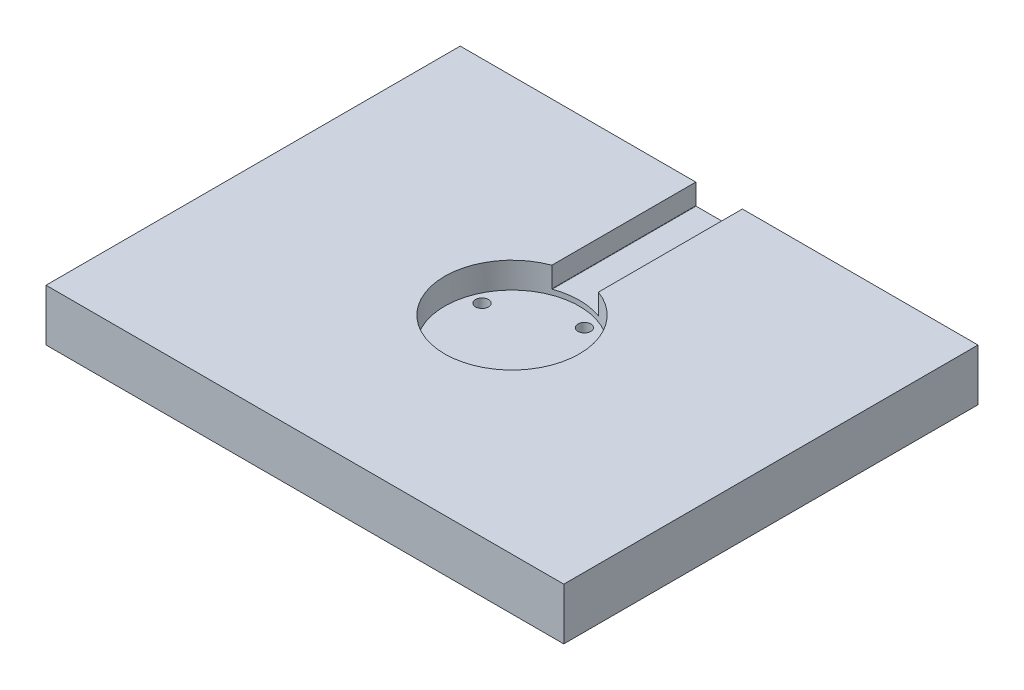
ISO-10303-21;
HEADER;
FILE_DESCRIPTION(('STEP AP214'),'2;1');
FILE_NAME('part.step','',(''),(''),'','','');
FILE_SCHEMA(('AUTOMOTIVE_DESIGN { 1 0 10303 214 1 1 1 1 }'));
ENDSEC;
DATA;
#1=APPLICATION_CONTEXT('core data for automotive mechanical design processes');
#2=APPLICATION_PROTOCOL_DEFINITION('international standard','automotive_design',2000,#1);
#3=PRODUCT_CONTEXT('',#1,'mechanical');
#4=PRODUCT('Part','Part','',(#3));
#5=PRODUCT_RELATED_PRODUCT_CATEGORY('part','',(#4));
#6=PRODUCT_DEFINITION_FORMATION('','',#4);
#7=PRODUCT_DEFINITION_CONTEXT('part definition',#1,'design');
#8=PRODUCT_DEFINITION('design','',#6,#7);
#9=PRODUCT_DEFINITION_SHAPE('','',#8);
#10=(LENGTH_UNIT() NAMED_UNIT(*) SI_UNIT(.MILLI.,.METRE.));
#11=(NAMED_UNIT(*) PLANE_ANGLE_UNIT() SI_UNIT($,.RADIAN.));
#12=(NAMED_UNIT(*) SI_UNIT($,.STERADIAN.) SOLID_ANGLE_UNIT());
#13=UNCERTAINTY_MEASURE_WITH_UNIT(LENGTH_MEASURE(1.E-05),#10,'distance_accuracy_value','');
#14=(GEOMETRIC_REPRESENTATION_CONTEXT(3) GLOBAL_UNCERTAINTY_ASSIGNED_CONTEXT((#13)) GLOBAL_UNIT_ASSIGNED_CONTEXT((#10,
#11,#12)) REPRESENTATION_CONTEXT('',''));
#15=CARTESIAN_POINT('',(0.,0.,0.));
#16=DIRECTION('',(0.,0.,1.));
#17=DIRECTION('',(1.,0.,0.));
#18=AXIS2_PLACEMENT_3D('',#15,#16,#17);
#19=CARTESIAN_POINT('',(100.,20.,-80.));
#20=DIRECTION('',(0.,0.,1.));
#21=DIRECTION('',(1.,0.,0.));
#22=AXIS2_PLACEMENT_3D('',#19,#20,#21);
#23=PLANE('',#22);
#24=DIRECTION('',(0.,-1.,0.));
#25=VECTOR('',#24,1.);
#26=CARTESIAN_POINT('',(-9.,20.,-80.));
#27=LINE('',#26,#25);
#28=CARTESIAN_POINT('',(-9.,20.,-80.));
#29=VERTEX_POINT('',#28);
#30=CARTESIAN_POINT('',(-9.,12.1,-80.));
#31=VERTEX_POINT('',#30);
#32=EDGE_CURVE('E292',#29,#31,#27,.T.);
#33=ORIENTED_EDGE('',*,*,#32,.T.);
#34=CARTESIAN_POINT('',(-8.9,12.1,-80.));
#35=DIRECTION('',(0.,0.,1.));
#36=DIRECTION('',(1.,0.,0.));
#37=AXIS2_PLACEMENT_3D('',#34,#35,#36);
#38=CIRCLE('',#37,0.1);
#39=CARTESIAN_POINT('',(-8.9,12.,-80.));
#40=VERTEX_POINT('',#39);
#41=EDGE_CURVE('E49',#31,#40,#38,.T.);
#42=ORIENTED_EDGE('',*,*,#41,.T.);
#43=DIRECTION('',(-1.,0.,0.));
#44=VECTOR('',#43,1.);
#45=CARTESIAN_POINT('',(9.,12.,-80.));
#46=LINE('',#45,#44);
#47=CARTESIAN_POINT('',(8.9,12.,-80.));
#48=VERTEX_POINT('',#47);
#49=EDGE_CURVE('E295',#48,#40,#46,.T.);
#50=ORIENTED_EDGE('',*,*,#49,.F.);
#51=CARTESIAN_POINT('',(8.9,12.1,-80.));
#52=DIRECTION('',(0.,0.,1.));
#53=DIRECTION('',(1.,0.,0.));
#54=AXIS2_PLACEMENT_3D('',#51,#52,#53);
#55=CIRCLE('',#54,0.1);
#56=CARTESIAN_POINT('',(9.,12.1,-80.));
#57=VERTEX_POINT('',#56);
#58=EDGE_CURVE('E184',#48,#57,#55,.T.);
#59=ORIENTED_EDGE('',*,*,#58,.T.);
#60=DIRECTION('',(0.,-1.,0.));
#61=VECTOR('',#60,1.);
#62=CARTESIAN_POINT('',(9.,20.,-80.));
#63=LINE('',#62,#61);
#64=CARTESIAN_POINT('',(9.,20.,-80.));
#65=VERTEX_POINT('',#64);
#66=EDGE_CURVE('E136',#65,#57,#63,.T.);
#67=ORIENTED_EDGE('',*,*,#66,.F.);
#68=DIRECTION('',(-1.,0.,0.));
#69=VECTOR('',#68,1.);
#70=CARTESIAN_POINT('',(100.,20.,-80.));
#71=LINE('',#70,#69);
#72=CARTESIAN_POINT('',(100.,20.,-80.));
#73=VERTEX_POINT('',#72);
#74=EDGE_CURVE('E135',#73,#65,#71,.T.);
#75=ORIENTED_EDGE('',*,*,#74,.F.);
#76=DIRECTION('',(0.,-1.,0.));
#77=VECTOR('',#76,1.);
#78=CARTESIAN_POINT('',(100.,20.,-80.));
#79=LINE('',#78,#77);
#80=CARTESIAN_POINT('',(100.,0.,-80.));
#81=VERTEX_POINT('',#80);
#82=EDGE_CURVE('E167',#73,#81,#79,.T.);
#83=ORIENTED_EDGE('',*,*,#82,.T.);
#84=DIRECTION('',(-1.,0.,0.));
#85=VECTOR('',#84,1.);
#86=CARTESIAN_POINT('',(100.,0.,-80.));
#87=LINE('',#86,#85);
#88=CARTESIAN_POINT('',(-100.,0.,-80.));
#89=VERTEX_POINT('',#88);
#90=EDGE_CURVE('E151',#81,#89,#87,.T.);
#91=ORIENTED_EDGE('',*,*,#90,.T.);
#92=DIRECTION('',(0.,-1.,0.));
#93=VECTOR('',#92,1.);
#94=CARTESIAN_POINT('',(-100.,20.,-80.));
#95=LINE('',#94,#93);
#96=CARTESIAN_POINT('',(-100.,20.,-80.));
#97=VERTEX_POINT('',#96);
#98=EDGE_CURVE('E157',#97,#89,#95,.T.);
#99=ORIENTED_EDGE('',*,*,#98,.F.);
#100=EDGE_CURVE('E155',#29,#97,#71,.T.);
#101=ORIENTED_EDGE('',*,*,#100,.F.);
#102=EDGE_LOOP('',(#33,#42,#50,#59,#67,#75,#83,#91,#99,#101));
#103=FACE_BOUND('',#102,.T.);
#104=ADVANCED_FACE('F35',(#103),#23,.F.);
#105=CARTESIAN_POINT('',(0.,20.,0.));
#106=DIRECTION('',(0.,-1.,0.));
#107=DIRECTION('',(0.,0.,-1.));
#108=AXIS2_PLACEMENT_3D('',#105,#106,#107);
#109=PLANE('',#108);
#110=DIRECTION('',(0.,0.,-1.));
#111=VECTOR('',#110,1.);
#112=CARTESIAN_POINT('',(-9.,20.,80.001));
#113=LINE('',#112,#111);
#114=CARTESIAN_POINT('',(-9.,20.,-24.3926218353009));
#115=VERTEX_POINT('',#114);
#116=EDGE_CURVE('E127',#115,#29,#113,.T.);
#117=ORIENTED_EDGE('',*,*,#116,.T.);
#118=ORIENTED_EDGE('',*,*,#100,.T.);
#119=DIRECTION('',(0.,0.,1.));
#120=VECTOR('',#119,1.);
#121=CARTESIAN_POINT('',(-100.,20.,-80.));
#122=LINE('',#121,#120);
#123=CARTESIAN_POINT('',(-100.,20.,80.));
#124=VERTEX_POINT('',#123);
#125=EDGE_CURVE('E147',#97,#124,#122,.T.);
#126=ORIENTED_EDGE('',*,*,#125,.T.);
#127=DIRECTION('',(1.,0.,0.));
#128=VECTOR('',#127,1.);
#129=CARTESIAN_POINT('',(100.,20.,80.));
#130=LINE('',#129,#128);
#131=CARTESIAN_POINT('',(100.,20.,80.));
#132=VERTEX_POINT('',#131);
#133=EDGE_CURVE('E150',#124,#132,#130,.T.);
#134=ORIENTED_EDGE('',*,*,#133,.T.);
#135=DIRECTION('',(0.,0.,-1.));
#136=VECTOR('',#135,1.);
#137=CARTESIAN_POINT('',(100.,20.,-80.));
#138=LINE('',#137,#136);
#139=EDGE_CURVE('E153',#132,#73,#138,.T.);
#140=ORIENTED_EDGE('',*,*,#139,.T.);
#141=ORIENTED_EDGE('',*,*,#74,.T.);
#142=DIRECTION('',(0.,0.,-1.));
#143=VECTOR('',#142,1.);
#144=CARTESIAN_POINT('',(9.,20.,80.001));
#145=LINE('',#144,#143);
#146=CARTESIAN_POINT('',(9.,20.,-24.3926218353009));
#147=VERTEX_POINT('',#146);
#148=EDGE_CURVE('E120',#147,#65,#145,.T.);
#149=ORIENTED_EDGE('',*,*,#148,.F.);
#150=CARTESIAN_POINT('',(0.,20.,0.));
#151=DIRECTION('',(0.,1.,0.));
#152=DIRECTION('',(0.,0.,1.));
#153=AXIS2_PLACEMENT_3D('',#150,#151,#152);
#154=CIRCLE('',#153,26.);
#155=EDGE_CURVE('E126',#115,#147,#154,.T.);
#156=ORIENTED_EDGE('',*,*,#155,.F.);
#157=EDGE_LOOP('',(#117,#118,#126,#134,#140,#141,#149,#156));
#158=FACE_BOUND('',#157,.T.);
#159=ADVANCED_FACE('F133',(#158),#109,.F.);
#160=CARTESIAN_POINT('',(0.,10.,0.));
#161=DIRECTION('',(0.,1.,0.));
#162=DIRECTION('',(0.,0.,1.));
#163=AXIS2_PLACEMENT_3D('',#160,#161,#162);
#164=CYLINDRICAL_SURFACE('',#163,26.);
#165=CARTESIAN_POINT('',(0.,10.,0.));
#166=DIRECTION('',(0.,1.,0.));
#167=DIRECTION('',(0.,0.,1.));
#168=AXIS2_PLACEMENT_3D('',#165,#166,#167);
#169=CIRCLE('',#168,26.);
#170=CARTESIAN_POINT('',(0.,10.,26.));
#171=VERTEX_POINT('',#170);
#172=EDGE_CURVE('E141',#171,#171,#169,.T.);
#173=ORIENTED_EDGE('',*,*,#172,.F.);
#174=EDGE_LOOP('',(#173));
#175=FACE_BOUND('',#174,.T.);
#176=CARTESIAN_POINT('',(0.,12.,0.));
#177=DIRECTION('',(0.,-1.,0.));
#178=DIRECTION('',(1.,0.,0.));
#179=AXIS2_PLACEMENT_3D('',#176,#177,#178);
#180=CIRCLE('',#179,26.);
#181=CARTESIAN_POINT('',(-8.9,12.,-24.4292857038432));
#182=VERTEX_POINT('',#181);
#183=CARTESIAN_POINT('',(8.9,12.,-24.4292857038432));
#184=VERTEX_POINT('',#183);
#185=EDGE_CURVE('E288',#182,#184,#180,.T.);
#186=ORIENTED_EDGE('',*,*,#185,.F.);
#187=CARTESIAN_POINT('',(-8.9,12.,-24.4292857038432));
#188=CARTESIAN_POINT('',(-8.90590598228734,11.9999966404818,-24.4271341492857));
#189=CARTESIAN_POINT('',(-8.91181181594646,12.0005230835553,-24.4249800370376));
#190=CARTESIAN_POINT('',(-8.92346485031673,12.0026126067,-24.4207250580384));
#191=CARTESIAN_POINT('',(-8.92921185711587,12.0041769002784,-24.4186242566101));
#192=CARTESIAN_POINT('',(-8.94038038613971,12.0083213135729,-24.4145373557674));
#193=CARTESIAN_POINT('',(-8.94580154610472,12.0109025406381,-24.4125513841048));
#194=CARTESIAN_POINT('',(-8.95613777588318,12.0170266172897,-24.4087612622393));
#195=CARTESIAN_POINT('',(-8.96105320329922,12.020568780864,-24.406956983581));
#196=CARTESIAN_POINT('',(-8.97006516020204,12.0284080059203,-24.4036463137854));
#197=CARTESIAN_POINT('',(-8.97418263729665,12.0326777164032,-24.4021323187584));
#198=CARTESIAN_POINT('',(-8.98163324426015,12.0419372324302,-24.399390977422));
#199=CARTESIAN_POINT('',(-8.98496638719338,12.046927025978,-24.3981636263381));
#200=CARTESIAN_POINT('',(-8.99053224875981,12.0571544728808,-24.3961131775926));
#201=CARTESIAN_POINT('',(-8.99281979090251,12.0623583157937,-24.3952699506678));
#202=CARTESIAN_POINT('',(-8.99648480596662,12.0731144037056,-24.3939186070639));
#203=CARTESIAN_POINT('',(-8.99786369536562,12.0786660915897,-24.3934099688045));
#204=CARTESIAN_POINT('',(-8.99917238580419,12.0868934175943,-24.3929271824796));
#205=CARTESIAN_POINT('',(-8.99948264127022,12.0895057142659,-24.3928127172082));
#206=CARTESIAN_POINT('',(-8.99989628457444,12.0947448737881,-24.3926601029283));
#207=CARTESIAN_POINT('',(-8.99999998398665,12.0973717086972,-24.3926218389759));
#208=CARTESIAN_POINT('',(-9.00000000000001,12.1,-24.3926218353009));
#209=B_SPLINE_CURVE_WITH_KNOTS('',3,(#187,#188,#189,#190,#191,#192,#193,#194,#195,#196,#197,
#198,#199,#200,#201,#202,#203,#204,#205,#206,#207,#208),.UNSPECIFIED.,.F.,.F.,(4,2,2,2,2,2,2,2,
2,2,4),(0.,0.0188365655716365,0.0376951947146541,0.056574416222432,0.0754401951702948,
0.0937106027723532,0.111980706030039,0.129133691104725,0.146259873134788,0.154151461469977,
0.162031136905623),.UNSPECIFIED.);
#210=CARTESIAN_POINT('',(-9.,12.1,-24.3926218353009));
#211=VERTEX_POINT('',#210);
#212=EDGE_CURVE('E11',#182,#211,#209,.T.);
#213=ORIENTED_EDGE('',*,*,#212,.T.);
#214=DIRECTION('',(0.,1.,0.));
#215=VECTOR('',#214,1.);
#216=CARTESIAN_POINT('',(-9.,10.,-24.3926218353009));
#217=LINE('',#216,#215);
#218=EDGE_CURVE('E139',#211,#115,#217,.T.);
#219=ORIENTED_EDGE('',*,*,#218,.T.);
#220=ORIENTED_EDGE('',*,*,#155,.T.);
#221=DIRECTION('',(0.,1.,0.));
#222=VECTOR('',#221,1.);
#223=CARTESIAN_POINT('',(9.,10.,-24.3926218353009));
#224=LINE('',#223,#222);
#225=CARTESIAN_POINT('',(9.,12.1,-24.3926218353009));
#226=VERTEX_POINT('',#225);
#227=EDGE_CURVE('E116',#226,#147,#224,.T.);
#228=ORIENTED_EDGE('',*,*,#227,.F.);
#229=CARTESIAN_POINT('',(9.,12.1,-24.3926218353009));
#230=CARTESIAN_POINT('',(9.00000578839041,12.0946234862205,-24.3926196487411));
#231=CARTESIAN_POINT('',(8.99956679230312,12.0892504507186,-24.3927816729836));
#232=CARTESIAN_POINT('',(8.99784430383788,12.0786736877902,-24.3934171319901));
#233=CARTESIAN_POINT('',(8.9965629205575,12.0734695714974,-24.3938897890173));
#234=CARTESIAN_POINT('',(8.99320055056396,12.0633653669278,-24.3951295724452));
#235=CARTESIAN_POINT('',(8.99111967041088,12.0584652382354,-24.3958966596032));
#236=CARTESIAN_POINT('',(8.98623447644217,12.0490928524832,-24.3976965456469));
#237=CARTESIAN_POINT('',(8.98342993713718,12.0446207293846,-24.3987294273529));
#238=CARTESIAN_POINT('',(8.97710813612369,12.0360999936993,-24.4010561472156));
#239=CARTESIAN_POINT('',(8.97357425170097,12.0320654014259,-24.4023560675519));
#240=CARTESIAN_POINT('',(8.96595162244072,12.0246428317023,-24.4051578151589));
#241=CARTESIAN_POINT('',(8.96186273572245,12.0212550201298,-24.4066596940573));
#242=CARTESIAN_POINT('',(8.9529918030313,12.015011874208,-24.409915225967));
#243=CARTESIAN_POINT('',(8.94818319138075,12.0121993229106,-24.4116784711651));
#244=CARTESIAN_POINT('',(8.93820656780221,12.0074210509867,-24.415333124699));
#245=CARTESIAN_POINT('',(8.93303846957134,12.0054555345307,-24.417224563808));
#246=CARTESIAN_POINT('',(8.92323869018001,12.0026238966922,-24.4208074059201));
#247=CARTESIAN_POINT('',(8.91863665370744,12.0016403749274,-24.4224884935135));
#248=CARTESIAN_POINT('',(8.90935672668919,12.0003283887674,-24.4258753688236));
#249=CARTESIAN_POINT('',(8.90467895630445,11.9999989729757,-24.4275811170259));
#250=CARTESIAN_POINT('',(8.90000000000165,11.9999999999936,-24.4292857038427));
#251=B_SPLINE_CURVE_WITH_KNOTS('',3,(#229,#230,#231,#232,#233,#234,#235,#236,#237,#238,#239,
#240,#241,#242,#243,#244,#245,#246,#247,#248,#249,#250),.UNSPECIFIED.,.F.,.F.,(4,2,2,2,2,2,2,2,
2,2,4),(0.,0.0161038479306266,0.0321675291891436,0.0482290701594389,0.0642956218998208,
0.0807795582616993,0.0972677165402071,0.114721127746399,0.132178743597338,0.147127549295317,
0.162054595996647),.UNSPECIFIED.);
#252=EDGE_CURVE('E186',#226,#184,#251,.T.);
#253=ORIENTED_EDGE('',*,*,#252,.T.);
#254=EDGE_LOOP('',(#186,#213,#219,#220,#228,#253));
#255=FACE_BOUND('',#254,.T.);
#256=ADVANCED_FACE('F138',(#175,#255),#164,.F.);
#257=CARTESIAN_POINT('',(-100.,20.,-80.));
#258=DIRECTION('',(1.,0.,0.));
#259=DIRECTION('',(0.,0.,-1.));
#260=AXIS2_PLACEMENT_3D('',#257,#258,#259);
#261=PLANE('',#260);
#262=DIRECTION('',(0.,0.,1.));
#263=VECTOR('',#262,1.);
#264=CARTESIAN_POINT('',(-100.,0.,-80.));
#265=LINE('',#264,#263);
#266=CARTESIAN_POINT('',(-100.,0.,80.));
#267=VERTEX_POINT('',#266);
#268=EDGE_CURVE('E144',#89,#267,#265,.T.);
#269=ORIENTED_EDGE('',*,*,#268,.T.);
#270=DIRECTION('',(0.,-1.,0.));
#271=VECTOR('',#270,1.);
#272=CARTESIAN_POINT('',(-100.,20.,80.));
#273=LINE('',#272,#271);
#274=EDGE_CURVE('E173',#124,#267,#273,.T.);
#275=ORIENTED_EDGE('',*,*,#274,.F.);
#276=ORIENTED_EDGE('',*,*,#125,.F.);
#277=ORIENTED_EDGE('',*,*,#98,.T.);
#278=EDGE_LOOP('',(#269,#275,#276,#277));
#279=FACE_BOUND('',#278,.T.);
#280=ADVANCED_FACE('F200',(#279),#261,.F.);
#281=CARTESIAN_POINT('',(100.,20.,80.));
#282=DIRECTION('',(0.,0.,-1.));
#283=DIRECTION('',(-1.,0.,0.));
#284=AXIS2_PLACEMENT_3D('',#281,#282,#283);
#285=PLANE('',#284);
#286=DIRECTION('',(1.,0.,0.));
#287=VECTOR('',#286,1.);
#288=CARTESIAN_POINT('',(100.,0.,80.));
#289=LINE('',#288,#287);
#290=CARTESIAN_POINT('',(100.,0.,80.));
#291=VERTEX_POINT('',#290);
#292=EDGE_CURVE('E160',#267,#291,#289,.T.);
#293=ORIENTED_EDGE('',*,*,#292,.T.);
#294=DIRECTION('',(0.,-1.,0.));
#295=VECTOR('',#294,1.);
#296=CARTESIAN_POINT('',(100.,20.,80.));
#297=LINE('',#296,#295);
#298=EDGE_CURVE('E170',#132,#291,#297,.T.);
#299=ORIENTED_EDGE('',*,*,#298,.F.);
#300=ORIENTED_EDGE('',*,*,#133,.F.);
#301=ORIENTED_EDGE('',*,*,#274,.T.);
#302=EDGE_LOOP('',(#293,#299,#300,#301));
#303=FACE_BOUND('',#302,.T.);
#304=ADVANCED_FACE('F203',(#303),#285,.F.);
#305=CARTESIAN_POINT('',(100.,20.,-80.));
#306=DIRECTION('',(-1.,0.,0.));
#307=DIRECTION('',(0.,0.,1.));
#308=AXIS2_PLACEMENT_3D('',#305,#306,#307);
#309=PLANE('',#308);
#310=DIRECTION('',(0.,0.,-1.));
#311=VECTOR('',#310,1.);
#312=CARTESIAN_POINT('',(100.,0.,-80.));
#313=LINE('',#312,#311);
#314=EDGE_CURVE('E162',#291,#81,#313,.T.);
#315=ORIENTED_EDGE('',*,*,#314,.T.);
#316=ORIENTED_EDGE('',*,*,#82,.F.);
#317=ORIENTED_EDGE('',*,*,#139,.F.);
#318=ORIENTED_EDGE('',*,*,#298,.T.);
#319=EDGE_LOOP('',(#315,#316,#317,#318));
#320=FACE_BOUND('',#319,.T.);
#321=ADVANCED_FACE('F207',(#320),#309,.F.);
#322=CARTESIAN_POINT('',(0.,0.,0.));
#323=DIRECTION('',(0.,-1.,0.));
#324=DIRECTION('',(0.,0.,-1.));
#325=AXIS2_PLACEMENT_3D('',#322,#323,#324);
#326=PLANE('',#325);
#327=CARTESIAN_POINT('',(-8.18942545261293,0.,19.7710219957415));
#328=DIRECTION('',(0.,-1.,0.));
#329=DIRECTION('',(0.,0.,-1.));
#330=AXIS2_PLACEMENT_3D('',#327,#328,#329);
#331=CIRCLE('',#330,2.5);
#332=CARTESIAN_POINT('',(-8.18942545261293,0.,17.2710219957415));
#333=VERTEX_POINT('',#332);
#334=EDGE_CURVE('E264',#333,#333,#331,.T.);
#335=ORIENTED_EDGE('',*,*,#334,.F.);
#336=EDGE_LOOP('',(#335));
#337=FACE_BOUND('',#336,.T.);
#338=CARTESIAN_POINT('',(19.7710219957415,0.,8.18942545261294));
#339=DIRECTION('',(0.,-1.,0.));
#340=DIRECTION('',(0.,0.,-1.));
#341=AXIS2_PLACEMENT_3D('',#338,#339,#340);
#342=CIRCLE('',#341,2.5);
#343=CARTESIAN_POINT('',(19.7710219957415,0.,5.68942545261294));
#344=VERTEX_POINT('',#343);
#345=EDGE_CURVE('E267',#344,#344,#342,.T.);
#346=ORIENTED_EDGE('',*,*,#345,.F.);
#347=EDGE_LOOP('',(#346));
#348=FACE_BOUND('',#347,.T.);
#349=CARTESIAN_POINT('',(8.18942545261293,0.,-19.7710219957415));
#350=DIRECTION('',(0.,-1.,0.));
#351=DIRECTION('',(0.,0.,-1.));
#352=AXIS2_PLACEMENT_3D('',#349,#350,#351);
#353=CIRCLE('',#352,2.5);
#354=CARTESIAN_POINT('',(8.18942545261293,0.,-22.2710219957415));
#355=VERTEX_POINT('',#354);
#356=EDGE_CURVE('E276',#355,#355,#353,.T.);
#357=ORIENTED_EDGE('',*,*,#356,.F.);
#358=EDGE_LOOP('',(#357));
#359=FACE_BOUND('',#358,.T.);
#360=CARTESIAN_POINT('',(-19.7710219957415,0.,-8.18942545261292));
#361=DIRECTION('',(0.,-1.,0.));
#362=DIRECTION('',(0.,0.,-1.));
#363=AXIS2_PLACEMENT_3D('',#360,#361,#362);
#364=CIRCLE('',#363,2.5);
#365=CARTESIAN_POINT('',(-19.7710219957415,0.,-10.6894254526129));
#366=VERTEX_POINT('',#365);
#367=EDGE_CURVE('E282',#366,#366,#364,.T.);
#368=ORIENTED_EDGE('',*,*,#367,.F.);
#369=EDGE_LOOP('',(#368));
#370=FACE_BOUND('',#369,.T.);
#371=ORIENTED_EDGE('',*,*,#268,.F.);
#372=ORIENTED_EDGE('',*,*,#90,.F.);
#373=ORIENTED_EDGE('',*,*,#314,.F.);
#374=ORIENTED_EDGE('',*,*,#292,.F.);
#375=EDGE_LOOP('',(#371,#372,#373,#374));
#376=FACE_BOUND('',#375,.T.);
#377=ADVANCED_FACE('F211',(#337,#348,#359,#370,#376),#326,.T.);
#378=CARTESIAN_POINT('',(0.,10.,0.));
#379=DIRECTION('',(0.,1.,0.));
#380=DIRECTION('',(0.,0.,1.));
#381=AXIS2_PLACEMENT_3D('',#378,#379,#380);
#382=PLANE('',#381);
#383=CARTESIAN_POINT('',(-8.18942545261293,10.,19.7710219957415));
#384=DIRECTION('',(0.,1.,0.));
#385=DIRECTION('',(0.,0.,1.));
#386=AXIS2_PLACEMENT_3D('',#383,#384,#385);
#387=CIRCLE('',#386,2.5);
#388=CARTESIAN_POINT('',(-8.18942545261293,10.,22.2710219957415));
#389=VERTEX_POINT('',#388);
#390=EDGE_CURVE('E266',#389,#389,#387,.T.);
#391=ORIENTED_EDGE('',*,*,#390,.F.);
#392=EDGE_LOOP('',(#391));
#393=FACE_BOUND('',#392,.T.);
#394=CARTESIAN_POINT('',(19.7710219957415,10.,8.18942545261294));
#395=DIRECTION('',(0.,1.,0.));
#396=DIRECTION('',(0.,0.,1.));
#397=AXIS2_PLACEMENT_3D('',#394,#395,#396);
#398=CIRCLE('',#397,2.5);
#399=CARTESIAN_POINT('',(19.7710219957415,10.,10.6894254526129));
#400=VERTEX_POINT('',#399);
#401=EDGE_CURVE('E270',#400,#400,#398,.T.);
#402=ORIENTED_EDGE('',*,*,#401,.F.);
#403=EDGE_LOOP('',(#402));
#404=FACE_BOUND('',#403,.T.);
#405=CARTESIAN_POINT('',(8.18942545261293,10.,-19.7710219957415));
#406=DIRECTION('',(0.,1.,0.));
#407=DIRECTION('',(0.,0.,1.));
#408=AXIS2_PLACEMENT_3D('',#405,#406,#407);
#409=CIRCLE('',#408,2.5);
#410=CARTESIAN_POINT('',(8.18942545261293,10.,-17.2710219957415));
#411=VERTEX_POINT('',#410);
#412=EDGE_CURVE('E279',#411,#411,#409,.T.);
#413=ORIENTED_EDGE('',*,*,#412,.F.);
#414=EDGE_LOOP('',(#413));
#415=FACE_BOUND('',#414,.T.);
#416=CARTESIAN_POINT('',(-19.7710219957415,10.,-8.18942545261292));
#417=DIRECTION('',(0.,1.,0.));
#418=DIRECTION('',(0.,0.,1.));
#419=AXIS2_PLACEMENT_3D('',#416,#417,#418);
#420=CIRCLE('',#419,2.5);
#421=CARTESIAN_POINT('',(-19.7710219957415,10.,-5.68942545261292));
#422=VERTEX_POINT('',#421);
#423=EDGE_CURVE('E285',#422,#422,#420,.T.);
#424=ORIENTED_EDGE('',*,*,#423,.F.);
#425=EDGE_LOOP('',(#424));
#426=FACE_BOUND('',#425,.T.);
#427=ORIENTED_EDGE('',*,*,#172,.T.);
#428=EDGE_LOOP('',(#427));
#429=FACE_BOUND('',#428,.T.);
#430=ADVANCED_FACE('F217',(#393,#404,#415,#426,#429),#382,.T.);
#431=CARTESIAN_POINT('',(-9.,20.,80.001));
#432=DIRECTION('',(1.,0.,0.));
#433=DIRECTION('',(0.,1.,0.));
#434=AXIS2_PLACEMENT_3D('',#431,#432,#433);
#435=PLANE('',#434);
#436=ORIENTED_EDGE('',*,*,#218,.F.);
#437=DIRECTION('',(0.,0.,-1.));
#438=VECTOR('',#437,1.);
#439=CARTESIAN_POINT('',(-9.,12.1,80.001));
#440=LINE('',#439,#438);
#441=EDGE_CURVE('E182',#211,#31,#440,.T.);
#442=ORIENTED_EDGE('',*,*,#441,.T.);
#443=ORIENTED_EDGE('',*,*,#32,.F.);
#444=ORIENTED_EDGE('',*,*,#116,.F.);
#445=EDGE_LOOP('',(#436,#442,#443,#444));
#446=FACE_BOUND('',#445,.T.);
#447=ADVANCED_FACE('F229',(#446),#435,.T.);
#448=CARTESIAN_POINT('',(9.,20.,80.001));
#449=DIRECTION('',(1.,0.,0.));
#450=DIRECTION('',(0.,1.,0.));
#451=AXIS2_PLACEMENT_3D('',#448,#449,#450);
#452=PLANE('',#451);
#453=ORIENTED_EDGE('',*,*,#66,.T.);
#454=DIRECTION('',(0.,0.,-1.));
#455=VECTOR('',#454,1.);
#456=CARTESIAN_POINT('',(9.,12.1,-24.3926218353009));
#457=LINE('',#456,#455);
#458=EDGE_CURVE('E123',#57,#226,#457,.F.);
#459=ORIENTED_EDGE('',*,*,#458,.T.);
#460=ORIENTED_EDGE('',*,*,#227,.T.);
#461=ORIENTED_EDGE('',*,*,#148,.T.);
#462=EDGE_LOOP('',(#453,#459,#460,#461));
#463=FACE_BOUND('',#462,.T.);
#464=ADVANCED_FACE('F119',(#463),#452,.F.);
#465=CARTESIAN_POINT('',(9.,12.,80.001));
#466=DIRECTION('',(0.,-1.,0.));
#467=DIRECTION('',(1.,0.,0.));
#468=AXIS2_PLACEMENT_3D('',#465,#466,#467);
#469=PLANE('',#468);
#470=ORIENTED_EDGE('',*,*,#185,.T.);
#471=DIRECTION('',(0.,0.,-1.));
#472=VECTOR('',#471,1.);
#473=CARTESIAN_POINT('',(8.9,12.,-80.));
#474=LINE('',#473,#472);
#475=EDGE_CURVE('E178',#184,#48,#474,.T.);
#476=ORIENTED_EDGE('',*,*,#475,.T.);
#477=ORIENTED_EDGE('',*,*,#49,.T.);
#478=DIRECTION('',(0.,0.,-1.));
#479=VECTOR('',#478,1.);
#480=CARTESIAN_POINT('',(-8.9,12.,80.001));
#481=LINE('',#480,#479);
#482=EDGE_CURVE('E176',#40,#182,#481,.F.);
#483=ORIENTED_EDGE('',*,*,#482,.T.);
#484=EDGE_LOOP('',(#470,#476,#477,#483));
#485=FACE_BOUND('',#484,.T.);
#486=ADVANCED_FACE('F198',(#485),#469,.F.);
#487=CARTESIAN_POINT('',(8.9,12.1,80.001));
#488=DIRECTION('',(0.,0.,1.));
#489=DIRECTION('',(1.,0.,0.));
#490=AXIS2_PLACEMENT_3D('',#487,#488,#489);
#491=CYLINDRICAL_SURFACE('',#490,0.1);
#492=ORIENTED_EDGE('',*,*,#252,.F.);
#493=ORIENTED_EDGE('',*,*,#458,.F.);
#494=ORIENTED_EDGE('',*,*,#58,.F.);
#495=ORIENTED_EDGE('',*,*,#475,.F.);
#496=EDGE_LOOP('',(#492,#493,#494,#495));
#497=FACE_BOUND('',#496,.T.);
#498=ADVANCED_FACE('F194',(#497),#491,.F.);
#499=CARTESIAN_POINT('',(-8.9,12.1,80.001));
#500=DIRECTION('',(0.,0.,-1.));
#501=DIRECTION('',(-1.,0.,0.));
#502=AXIS2_PLACEMENT_3D('',#499,#500,#501);
#503=CYLINDRICAL_SURFACE('',#502,0.1);
#504=ORIENTED_EDGE('',*,*,#212,.F.);
#505=ORIENTED_EDGE('',*,*,#482,.F.);
#506=ORIENTED_EDGE('',*,*,#41,.F.);
#507=ORIENTED_EDGE('',*,*,#441,.F.);
#508=EDGE_LOOP('',(#504,#505,#506,#507));
#509=FACE_BOUND('',#508,.T.);
#510=ADVANCED_FACE('F37',(#509),#503,.F.);
#511=CARTESIAN_POINT('',(-19.7710219957415,0.,-8.18942545261292));
#512=DIRECTION('',(0.,-1.,0.));
#513=DIRECTION('',(0.,0.,-1.));
#514=AXIS2_PLACEMENT_3D('',#511,#512,#513);
#515=CYLINDRICAL_SURFACE('',#514,2.5);
#516=ORIENTED_EDGE('',*,*,#367,.T.);
#517=EDGE_LOOP('',(#516));
#518=FACE_BOUND('',#517,.T.);
#519=ORIENTED_EDGE('',*,*,#423,.T.);
#520=EDGE_LOOP('',(#519));
#521=FACE_BOUND('',#520,.T.);
#522=ADVANCED_FACE('F244',(#518,#521),#515,.F.);
#523=CARTESIAN_POINT('',(8.18942545261293,0.,-19.7710219957415));
#524=DIRECTION('',(0.,-1.,0.));
#525=DIRECTION('',(0.,0.,-1.));
#526=AXIS2_PLACEMENT_3D('',#523,#524,#525);
#527=CYLINDRICAL_SURFACE('',#526,2.5);
#528=ORIENTED_EDGE('',*,*,#356,.T.);
#529=EDGE_LOOP('',(#528));
#530=FACE_BOUND('',#529,.T.);
#531=ORIENTED_EDGE('',*,*,#412,.T.);
#532=EDGE_LOOP('',(#531));
#533=FACE_BOUND('',#532,.T.);
#534=ADVANCED_FACE('F247',(#530,#533),#527,.F.);
#535=CARTESIAN_POINT('',(19.7710219957415,0.,8.18942545261294));
#536=DIRECTION('',(0.,-1.,0.));
#537=DIRECTION('',(0.,0.,-1.));
#538=AXIS2_PLACEMENT_3D('',#535,#536,#537);
#539=CYLINDRICAL_SURFACE('',#538,2.5);
#540=ORIENTED_EDGE('',*,*,#345,.T.);
#541=EDGE_LOOP('',(#540));
#542=FACE_BOUND('',#541,.T.);
#543=ORIENTED_EDGE('',*,*,#401,.T.);
#544=EDGE_LOOP('',(#543));
#545=FACE_BOUND('',#544,.T.);
#546=ADVANCED_FACE('F251',(#542,#545),#539,.F.);
#547=CARTESIAN_POINT('',(-8.18942545261293,0.,19.7710219957415));
#548=DIRECTION('',(0.,-1.,0.));
#549=DIRECTION('',(0.,0.,-1.));
#550=AXIS2_PLACEMENT_3D('',#547,#548,#549);
#551=CYLINDRICAL_SURFACE('',#550,2.5);
#552=ORIENTED_EDGE('',*,*,#334,.T.);
#553=EDGE_LOOP('',(#552));
#554=FACE_BOUND('',#553,.T.);
#555=ORIENTED_EDGE('',*,*,#390,.T.);
#556=EDGE_LOOP('',(#555));
#557=FACE_BOUND('',#556,.T.);
#558=ADVANCED_FACE('F255',(#554,#557),#551,.F.);
#559=CLOSED_SHELL('',(#104,#159,#256,#280,#304,#321,#377,#430,#447,#464,#486,#498,#510,#522,
#534,#546,#558));
#560=MANIFOLD_SOLID_BREP('B2',#559);
#561=ADVANCED_BREP_SHAPE_REPRESENTATION('',(#18,#560),#14);
#562=SHAPE_DEFINITION_REPRESENTATION(#9,#561);
ENDSEC;
END-ISO-10303-21;
